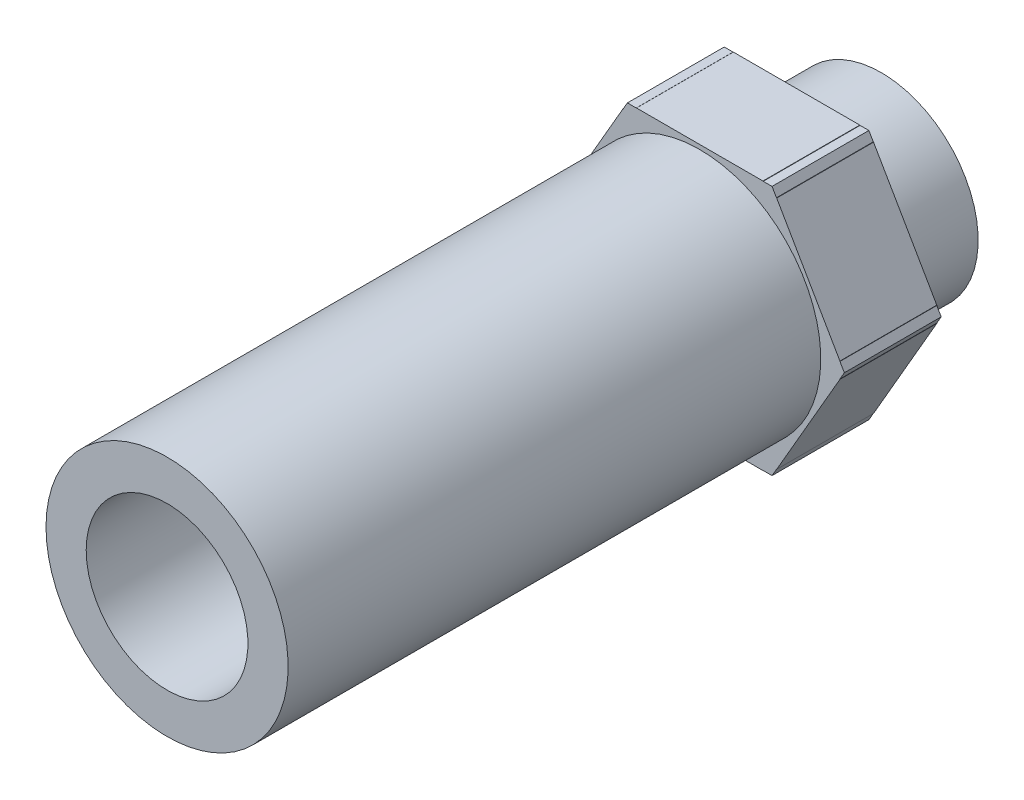
ISO-10303-21;
HEADER;
FILE_DESCRIPTION(('STEP AP214'),'2;1');
FILE_NAME('part.step','',(''),(''),'','','');
FILE_SCHEMA(('AUTOMOTIVE_DESIGN { 1 0 10303 214 1 1 1 1 }'));
ENDSEC;
DATA;
#1=APPLICATION_CONTEXT('core data for automotive mechanical design processes');
#2=APPLICATION_PROTOCOL_DEFINITION('international standard','automotive_design',2000,#1);
#3=PRODUCT_CONTEXT('',#1,'mechanical');
#4=PRODUCT('Part','Part','',(#3));
#5=PRODUCT_RELATED_PRODUCT_CATEGORY('part','',(#4));
#6=PRODUCT_DEFINITION_FORMATION('','',#4);
#7=PRODUCT_DEFINITION_CONTEXT('part definition',#1,'design');
#8=PRODUCT_DEFINITION('design','',#6,#7);
#9=PRODUCT_DEFINITION_SHAPE('','',#8);
#10=(LENGTH_UNIT() NAMED_UNIT(*) SI_UNIT(.MILLI.,.METRE.));
#11=(NAMED_UNIT(*) PLANE_ANGLE_UNIT() SI_UNIT($,.RADIAN.));
#12=(NAMED_UNIT(*) SI_UNIT($,.STERADIAN.) SOLID_ANGLE_UNIT());
#13=UNCERTAINTY_MEASURE_WITH_UNIT(LENGTH_MEASURE(1.E-05),#10,'distance_accuracy_value','');
#14=(GEOMETRIC_REPRESENTATION_CONTEXT(3) GLOBAL_UNCERTAINTY_ASSIGNED_CONTEXT((#13)) GLOBAL_UNIT_ASSIGNED_CONTEXT((#10,
#11,#12)) REPRESENTATION_CONTEXT('',''));
#15=CARTESIAN_POINT('',(0.,0.,0.));
#16=DIRECTION('',(0.,0.,1.));
#17=DIRECTION('',(1.,0.,0.));
#18=AXIS2_PLACEMENT_3D('',#15,#16,#17);
#19=CARTESIAN_POINT('',(0.,0.,-40.16));
#20=DIRECTION('',(0.,0.,-1.));
#21=DIRECTION('',(-1.,0.,0.));
#22=AXIS2_PLACEMENT_3D('',#19,#20,#21);
#23=CYLINDRICAL_SURFACE('',#22,29.);
#24=CARTESIAN_POINT('',(0.,0.,20.));
#25=DIRECTION('',(0.,0.,-1.));
#26=DIRECTION('',(-1.,0.,0.));
#27=AXIS2_PLACEMENT_3D('',#24,#25,#26);
#28=CIRCLE('',#27,29.);
#29=CARTESIAN_POINT('',(28.957156675231,-1.57577831122393,20.));
#30=VERTEX_POINT('',#29);
#31=CARTESIAN_POINT('',(28.9536877795527,-1.63828079528002,20.));
#32=VERTEX_POINT('',#31);
#33=EDGE_CURVE('E308',#30,#32,#28,.T.);
#34=ORIENTED_EDGE('',*,*,#33,.T.);
#35=DIRECTION('',(0.,0.,-1.));
#36=VECTOR('',#35,1.);
#37=CARTESIAN_POINT('',(28.9536877795527,-1.63828079528003,-40.16));
#38=LINE('',#37,#36);
#39=CARTESIAN_POINT('',(28.9536877795527,-1.63828079528003,0.));
#40=VERTEX_POINT('',#39);
#41=EDGE_CURVE('E307',#32,#40,#38,.T.);
#42=ORIENTED_EDGE('',*,*,#41,.T.);
#43=CARTESIAN_POINT('',(0.,0.,0.));
#44=DIRECTION('',(0.,0.,-1.));
#45=DIRECTION('',(-1.,0.,0.));
#46=AXIS2_PLACEMENT_3D('',#43,#44,#45);
#47=CIRCLE('',#46,29.);
#48=CARTESIAN_POINT('',(28.957156675231,-1.57577831122393,0.));
#49=VERTEX_POINT('',#48);
#50=EDGE_CURVE('E261',#49,#40,#47,.T.);
#51=ORIENTED_EDGE('',*,*,#50,.F.);
#52=DIRECTION('',(0.,0.,-1.));
#53=VECTOR('',#52,1.);
#54=CARTESIAN_POINT('',(28.957156675231,-1.57577831122395,-40.16));
#55=LINE('',#54,#53);
#56=EDGE_CURVE('E305',#30,#49,#55,.T.);
#57=ORIENTED_EDGE('',*,*,#56,.F.);
#58=EDGE_LOOP('',(#34,#42,#51,#57));
#59=FACE_BOUND('',#58,.T.);
#60=ADVANCED_FACE('F34',(#59),#23,.T.);
#61=CARTESIAN_POINT('',(15.8432423858679,24.2897441465043,20.));
#62=VERTEX_POINT('',#61);
#63=CARTESIAN_POINT('',(15.8956366770209,24.2554887526957,20.));
#64=VERTEX_POINT('',#63);
#65=EDGE_CURVE('E441',#62,#64,#28,.T.);
#66=ORIENTED_EDGE('',*,*,#65,.T.);
#67=DIRECTION('',(0.,0.,-1.));
#68=VECTOR('',#67,1.);
#69=CARTESIAN_POINT('',(15.8956366770209,24.2554887526957,-40.16));
#70=LINE('',#69,#68);
#71=CARTESIAN_POINT('',(15.8956366770209,24.2554887526957,0.));
#72=VERTEX_POINT('',#71);
#73=EDGE_CURVE('E315',#64,#72,#70,.T.);
#74=ORIENTED_EDGE('',*,*,#73,.T.);
#75=CARTESIAN_POINT('',(15.8432423858679,24.2897441465043,0.));
#76=VERTEX_POINT('',#75);
#77=EDGE_CURVE('E286',#76,#72,#47,.T.);
#78=ORIENTED_EDGE('',*,*,#77,.F.);
#79=DIRECTION('',(0.,0.,-1.));
#80=VECTOR('',#79,1.);
#81=CARTESIAN_POINT('',(15.8432423858679,24.2897441465043,-40.16));
#82=LINE('',#81,#80);
#83=EDGE_CURVE('E406',#62,#76,#82,.T.);
#84=ORIENTED_EDGE('',*,*,#83,.F.);
#85=EDGE_LOOP('',(#66,#74,#78,#84));
#86=FACE_BOUND('',#85,.T.);
#87=ADVANCED_FACE('F486',(#86),#23,.T.);
#88=CARTESIAN_POINT('',(-13.1139142893632,25.8655224577281,20.));
#89=VERTEX_POINT('',#88);
#90=CARTESIAN_POINT('',(-13.0580511025318,25.8937695479756,20.));
#91=VERTEX_POINT('',#90);
#92=EDGE_CURVE('E276',#89,#91,#28,.T.);
#93=ORIENTED_EDGE('',*,*,#92,.T.);
#94=DIRECTION('',(0.,0.,-1.));
#95=VECTOR('',#94,1.);
#96=CARTESIAN_POINT('',(-13.0580511025318,25.8937695479756,-40.16));
#97=LINE('',#96,#95);
#98=CARTESIAN_POINT('',(-13.0580511025318,25.8937695479756,0.));
#99=VERTEX_POINT('',#98);
#100=EDGE_CURVE('E480',#91,#99,#97,.T.);
#101=ORIENTED_EDGE('',*,*,#100,.T.);
#102=CARTESIAN_POINT('',(-13.1139142893632,25.8655224577281,0.));
#103=VERTEX_POINT('',#102);
#104=EDGE_CURVE('E277',#103,#99,#47,.T.);
#105=ORIENTED_EDGE('',*,*,#104,.F.);
#106=DIRECTION('',(0.,0.,-1.));
#107=VECTOR('',#106,1.);
#108=CARTESIAN_POINT('',(-13.1139142893632,25.8655224577281,-40.16));
#109=LINE('',#108,#107);
#110=EDGE_CURVE('E400',#89,#103,#109,.T.);
#111=ORIENTED_EDGE('',*,*,#110,.F.);
#112=EDGE_LOOP('',(#93,#101,#105,#111));
#113=FACE_BOUND('',#112,.T.);
#114=ADVANCED_FACE('F528',(#113),#23,.T.);
#115=CARTESIAN_POINT('',(-28.957156675231,1.57577831122371,20.));
#116=VERTEX_POINT('',#115);
#117=CARTESIAN_POINT('',(-28.9536877795527,1.63828079527978,20.));
#118=VERTEX_POINT('',#117);
#119=EDGE_CURVE('E267',#116,#118,#28,.T.);
#120=ORIENTED_EDGE('',*,*,#119,.T.);
#121=DIRECTION('',(0.,0.,-1.));
#122=VECTOR('',#121,1.);
#123=CARTESIAN_POINT('',(-28.9536877795527,1.63828079527978,-40.16));
#124=LINE('',#123,#122);
#125=CARTESIAN_POINT('',(-28.9536877795527,1.63828079527979,0.));
#126=VERTEX_POINT('',#125);
#127=EDGE_CURVE('E57',#118,#126,#124,.T.);
#128=ORIENTED_EDGE('',*,*,#127,.T.);
#129=CARTESIAN_POINT('',(-28.957156675231,1.57577831122372,0.));
#130=VERTEX_POINT('',#129);
#131=EDGE_CURVE('E264',#130,#126,#47,.T.);
#132=ORIENTED_EDGE('',*,*,#131,.F.);
#133=DIRECTION('',(0.,0.,-1.));
#134=VECTOR('',#133,1.);
#135=CARTESIAN_POINT('',(-28.957156675231,1.57577831122371,-40.16));
#136=LINE('',#135,#134);
#137=EDGE_CURVE('E394',#116,#130,#136,.T.);
#138=ORIENTED_EDGE('',*,*,#137,.F.);
#139=EDGE_LOOP('',(#120,#128,#132,#138));
#140=FACE_BOUND('',#139,.T.);
#141=ADVANCED_FACE('F560',(#140),#23,.T.);
#142=CARTESIAN_POINT('',(-15.8432423858677,-24.2897441465044,20.));
#143=VERTEX_POINT('',#142);
#144=CARTESIAN_POINT('',(-15.8956366770207,-24.2554887526958,20.));
#145=VERTEX_POINT('',#144);
#146=EDGE_CURVE('E427',#143,#145,#28,.T.);
#147=ORIENTED_EDGE('',*,*,#146,.T.);
#148=DIRECTION('',(0.,0.,-1.));
#149=VECTOR('',#148,1.);
#150=CARTESIAN_POINT('',(-15.8956366770207,-24.2554887526958,-40.16));
#151=LINE('',#150,#149);
#152=CARTESIAN_POINT('',(-15.8956366770207,-24.2554887526958,0.));
#153=VERTEX_POINT('',#152);
#154=EDGE_CURVE('E49',#145,#153,#151,.T.);
#155=ORIENTED_EDGE('',*,*,#154,.T.);
#156=CARTESIAN_POINT('',(-15.8432423858677,-24.2897441465044,0.));
#157=VERTEX_POINT('',#156);
#158=EDGE_CURVE('E257',#157,#153,#47,.T.);
#159=ORIENTED_EDGE('',*,*,#158,.F.);
#160=DIRECTION('',(0.,0.,-1.));
#161=VECTOR('',#160,1.);
#162=CARTESIAN_POINT('',(-15.8432423858677,-24.2897441465044,-40.16));
#163=LINE('',#162,#161);
#164=EDGE_CURVE('E388',#143,#157,#163,.T.);
#165=ORIENTED_EDGE('',*,*,#164,.F.);
#166=EDGE_LOOP('',(#147,#155,#159,#165));
#167=FACE_BOUND('',#166,.T.);
#168=ADVANCED_FACE('F469',(#167),#23,.T.);
#169=CARTESIAN_POINT('',(13.1139142893634,-25.865522457728,20.));
#170=VERTEX_POINT('',#169);
#171=CARTESIAN_POINT('',(13.058051102532,-25.8937695479755,20.));
#172=VERTEX_POINT('',#171);
#173=EDGE_CURVE('E434',#170,#172,#28,.T.);
#174=ORIENTED_EDGE('',*,*,#173,.T.);
#175=DIRECTION('',(0.,0.,-1.));
#176=VECTOR('',#175,1.);
#177=CARTESIAN_POINT('',(13.058051102532,-25.8937695479755,-40.16));
#178=LINE('',#177,#176);
#179=CARTESIAN_POINT('',(13.058051102532,-25.8937695479755,0.));
#180=VERTEX_POINT('',#179);
#181=EDGE_CURVE('E240',#172,#180,#178,.T.);
#182=ORIENTED_EDGE('',*,*,#181,.T.);
#183=CARTESIAN_POINT('',(13.1139142893634,-25.865522457728,0.));
#184=VERTEX_POINT('',#183);
#185=EDGE_CURVE('E250',#184,#180,#47,.T.);
#186=ORIENTED_EDGE('',*,*,#185,.F.);
#187=DIRECTION('',(0.,0.,-1.));
#188=VECTOR('',#187,1.);
#189=CARTESIAN_POINT('',(13.1139142893634,-25.865522457728,-40.16));
#190=LINE('',#189,#188);
#191=EDGE_CURVE('E382',#170,#184,#190,.T.);
#192=ORIENTED_EDGE('',*,*,#191,.F.);
#193=EDGE_LOOP('',(#174,#182,#186,#192));
#194=FACE_BOUND('',#193,.T.);
#195=ADVANCED_FACE('F537',(#194),#23,.T.);
#196=CARTESIAN_POINT('',(0.,0.,-40.16));
#197=DIRECTION('',(0.,0.,-1.));
#198=DIRECTION('',(-1.,0.,0.));
#199=AXIS2_PLACEMENT_3D('',#196,#197,#198);
#200=CYLINDRICAL_SURFACE('',#199,16.7);
#201=CARTESIAN_POINT('',(0.,0.,-17.5));
#202=DIRECTION('',(0.,0.,-1.));
#203=DIRECTION('',(-1.,0.,0.));
#204=AXIS2_PLACEMENT_3D('',#201,#202,#203);
#205=CIRCLE('',#204,16.7);
#206=CARTESIAN_POINT('',(-16.7,0.,-17.5));
#207=VERTEX_POINT('',#206);
#208=EDGE_CURVE('E417',#207,#207,#205,.T.);
#209=ORIENTED_EDGE('',*,*,#208,.T.);
#210=EDGE_LOOP('',(#209));
#211=FACE_BOUND('',#210,.T.);
#212=CARTESIAN_POINT('',(0.,0.,0.));
#213=DIRECTION('',(0.,0.,1.));
#214=DIRECTION('',(1.,0.,0.));
#215=AXIS2_PLACEMENT_3D('',#212,#213,#214);
#216=CIRCLE('',#215,16.7);
#217=CARTESIAN_POINT('',(16.7,0.,0.));
#218=VERTEX_POINT('',#217);
#219=EDGE_CURVE('E414',#218,#218,#216,.F.);
#220=ORIENTED_EDGE('',*,*,#219,.F.);
#221=EDGE_LOOP('',(#220));
#222=FACE_BOUND('',#221,.T.);
#223=ADVANCED_FACE('F531',(#211,#222),#200,.F.);
#224=CARTESIAN_POINT('',(15.8956366770213,-24.2554887526955,0.));
#225=VERTEX_POINT('',#224);
#226=CARTESIAN_POINT('',(15.8432423858683,-24.289744146504,0.));
#227=VERTEX_POINT('',#226);
#228=EDGE_CURVE('E259',#225,#227,#47,.T.);
#229=ORIENTED_EDGE('',*,*,#228,.F.);
#230=DIRECTION('',(0.,0.,-1.));
#231=VECTOR('',#230,1.);
#232=CARTESIAN_POINT('',(15.8956366770213,-24.2554887526955,-40.16));
#233=LINE('',#232,#231);
#234=CARTESIAN_POINT('',(15.8956366770213,-24.2554887526955,20.));
#235=VERTEX_POINT('',#234);
#236=EDGE_CURVE('E310',#225,#235,#233,.F.);
#237=ORIENTED_EDGE('',*,*,#236,.T.);
#238=CARTESIAN_POINT('',(15.8432423858683,-24.289744146504,20.));
#239=VERTEX_POINT('',#238);
#240=EDGE_CURVE('E448',#235,#239,#28,.T.);
#241=ORIENTED_EDGE('',*,*,#240,.T.);
#242=DIRECTION('',(0.,0.,-1.));
#243=VECTOR('',#242,1.);
#244=CARTESIAN_POINT('',(15.8432423858683,-24.289744146504,-40.16));
#245=LINE('',#244,#243);
#246=EDGE_CURVE('E409',#227,#239,#245,.F.);
#247=ORIENTED_EDGE('',*,*,#246,.F.);
#248=EDGE_LOOP('',(#229,#237,#241,#247));
#249=FACE_BOUND('',#248,.T.);
#250=ADVANCED_FACE('F524',(#249),#23,.T.);
#251=CARTESIAN_POINT('',(28.9536877795527,1.63828079527999,0.));
#252=VERTEX_POINT('',#251);
#253=CARTESIAN_POINT('',(28.957156675231,1.57577831122391,0.));
#254=VERTEX_POINT('',#253);
#255=EDGE_CURVE('E263',#252,#254,#47,.T.);
#256=ORIENTED_EDGE('',*,*,#255,.F.);
#257=DIRECTION('',(0.,0.,-1.));
#258=VECTOR('',#257,1.);
#259=CARTESIAN_POINT('',(28.9536877795527,1.63828079527999,-40.16));
#260=LINE('',#259,#258);
#261=CARTESIAN_POINT('',(28.9536877795527,1.63828079527998,20.));
#262=VERTEX_POINT('',#261);
#263=EDGE_CURVE('E483',#252,#262,#260,.F.);
#264=ORIENTED_EDGE('',*,*,#263,.T.);
#265=CARTESIAN_POINT('',(28.957156675231,1.5757783112239,20.));
#266=VERTEX_POINT('',#265);
#267=EDGE_CURVE('E442',#262,#266,#28,.T.);
#268=ORIENTED_EDGE('',*,*,#267,.T.);
#269=DIRECTION('',(0.,0.,-1.));
#270=VECTOR('',#269,1.);
#271=CARTESIAN_POINT('',(28.957156675231,1.57577831122392,-40.16));
#272=LINE('',#271,#270);
#273=EDGE_CURVE('E403',#254,#266,#272,.F.);
#274=ORIENTED_EDGE('',*,*,#273,.F.);
#275=EDGE_LOOP('',(#256,#264,#268,#274));
#276=FACE_BOUND('',#275,.T.);
#277=ADVANCED_FACE('F530',(#276),#23,.T.);
#278=CARTESIAN_POINT('',(13.0580511025316,25.8937695479757,0.));
#279=VERTEX_POINT('',#278);
#280=CARTESIAN_POINT('',(13.113914289363,25.8655224577282,0.));
#281=VERTEX_POINT('',#280);
#282=EDGE_CURVE('E278',#279,#281,#47,.T.);
#283=ORIENTED_EDGE('',*,*,#282,.F.);
#284=DIRECTION('',(0.,0.,-1.));
#285=VECTOR('',#284,1.);
#286=CARTESIAN_POINT('',(13.0580511025316,25.8937695479757,-40.16));
#287=LINE('',#286,#285);
#288=CARTESIAN_POINT('',(13.0580511025316,25.8937695479757,20.));
#289=VERTEX_POINT('',#288);
#290=EDGE_CURVE('E478',#279,#289,#287,.F.);
#291=ORIENTED_EDGE('',*,*,#290,.T.);
#292=CARTESIAN_POINT('',(13.113914289363,25.8655224577282,20.));
#293=VERTEX_POINT('',#292);
#294=EDGE_CURVE('E435',#289,#293,#28,.T.);
#295=ORIENTED_EDGE('',*,*,#294,.T.);
#296=DIRECTION('',(0.,0.,-1.));
#297=VECTOR('',#296,1.);
#298=CARTESIAN_POINT('',(13.113914289363,25.8655224577282,-40.16));
#299=LINE('',#298,#297);
#300=EDGE_CURVE('E397',#281,#293,#299,.F.);
#301=ORIENTED_EDGE('',*,*,#300,.F.);
#302=EDGE_LOOP('',(#283,#291,#295,#301));
#303=FACE_BOUND('',#302,.T.);
#304=ADVANCED_FACE('F536',(#303),#23,.T.);
#305=CARTESIAN_POINT('',(-15.8956366770211,24.2554887526956,0.));
#306=VERTEX_POINT('',#305);
#307=CARTESIAN_POINT('',(-15.8432423858681,24.2897441465042,0.));
#308=VERTEX_POINT('',#307);
#309=EDGE_CURVE('E268',#306,#308,#47,.T.);
#310=ORIENTED_EDGE('',*,*,#309,.F.);
#311=DIRECTION('',(0.,0.,-1.));
#312=VECTOR('',#311,1.);
#313=CARTESIAN_POINT('',(-15.8956366770211,24.2554887526956,-40.16));
#314=LINE('',#313,#312);
#315=CARTESIAN_POINT('',(-15.8956366770211,24.2554887526956,20.));
#316=VERTEX_POINT('',#315);
#317=EDGE_CURVE('E470',#306,#316,#314,.F.);
#318=ORIENTED_EDGE('',*,*,#317,.T.);
#319=CARTESIAN_POINT('',(-15.8432423858681,24.2897441465042,20.));
#320=VERTEX_POINT('',#319);
#321=EDGE_CURVE('E274',#316,#320,#28,.T.);
#322=ORIENTED_EDGE('',*,*,#321,.T.);
#323=DIRECTION('',(0.,0.,-1.));
#324=VECTOR('',#323,1.);
#325=CARTESIAN_POINT('',(-15.8432423858681,24.2897441465042,-40.16));
#326=LINE('',#325,#324);
#327=EDGE_CURVE('E391',#308,#320,#326,.F.);
#328=ORIENTED_EDGE('',*,*,#327,.F.);
#329=EDGE_LOOP('',(#310,#318,#322,#328));
#330=FACE_BOUND('',#329,.T.);
#331=ADVANCED_FACE('F546',(#330),#23,.T.);
#332=CARTESIAN_POINT('',(-28.9536877795526,-1.63828079528018,0.));
#333=VERTEX_POINT('',#332);
#334=CARTESIAN_POINT('',(-28.957156675231,-1.57577831122411,0.));
#335=VERTEX_POINT('',#334);
#336=EDGE_CURVE('E260',#333,#335,#47,.T.);
#337=ORIENTED_EDGE('',*,*,#336,.F.);
#338=DIRECTION('',(0.,0.,-1.));
#339=VECTOR('',#338,1.);
#340=CARTESIAN_POINT('',(-28.9536877795526,-1.63828079528018,-40.16));
#341=LINE('',#340,#339);
#342=CARTESIAN_POINT('',(-28.9536877795526,-1.63828079528018,20.));
#343=VERTEX_POINT('',#342);
#344=EDGE_CURVE('E471',#333,#343,#341,.F.);
#345=ORIENTED_EDGE('',*,*,#344,.T.);
#346=CARTESIAN_POINT('',(-28.957156675231,-1.57577831122414,20.));
#347=VERTEX_POINT('',#346);
#348=EDGE_CURVE('E275',#343,#347,#28,.T.);
#349=ORIENTED_EDGE('',*,*,#348,.T.);
#350=DIRECTION('',(0.,0.,-1.));
#351=VECTOR('',#350,1.);
#352=CARTESIAN_POINT('',(-28.957156675231,-1.57577831122412,-40.16));
#353=LINE('',#352,#351);
#354=EDGE_CURVE('E385',#335,#347,#353,.F.);
#355=ORIENTED_EDGE('',*,*,#354,.F.);
#356=EDGE_LOOP('',(#337,#345,#349,#355));
#357=FACE_BOUND('',#356,.T.);
#358=ADVANCED_FACE('F540',(#357),#23,.T.);
#359=CARTESIAN_POINT('',(-13.0580511025314,-25.8937695479758,0.));
#360=VERTEX_POINT('',#359);
#361=CARTESIAN_POINT('',(-13.1139142893628,-25.8655224577283,0.));
#362=VERTEX_POINT('',#361);
#363=EDGE_CURVE('E247',#360,#362,#47,.T.);
#364=ORIENTED_EDGE('',*,*,#363,.F.);
#365=DIRECTION('',(0.,0.,-1.));
#366=VECTOR('',#365,1.);
#367=CARTESIAN_POINT('',(-13.0580511025314,-25.8937695479758,-40.16));
#368=LINE('',#367,#366);
#369=CARTESIAN_POINT('',(-13.0580511025314,-25.8937695479758,20.));
#370=VERTEX_POINT('',#369);
#371=EDGE_CURVE('E230',#360,#370,#368,.F.);
#372=ORIENTED_EDGE('',*,*,#371,.T.);
#373=CARTESIAN_POINT('',(-13.1139142893628,-25.8655224577283,20.));
#374=VERTEX_POINT('',#373);
#375=EDGE_CURVE('E433',#370,#374,#28,.T.);
#376=ORIENTED_EDGE('',*,*,#375,.T.);
#377=DIRECTION('',(0.,0.,-1.));
#378=VECTOR('',#377,1.);
#379=CARTESIAN_POINT('',(-13.1139142893628,-25.8655224577283,-40.16));
#380=LINE('',#379,#378);
#381=EDGE_CURVE('E256',#362,#374,#380,.F.);
#382=ORIENTED_EDGE('',*,*,#381,.F.);
#383=EDGE_LOOP('',(#364,#372,#376,#382));
#384=FACE_BOUND('',#383,.T.);
#385=ADVANCED_FACE('F254',(#384),#23,.T.);
#386=CARTESIAN_POINT('',(0.,0.,20.));
#387=DIRECTION('',(0.,0.,1.));
#388=DIRECTION('',(1.,0.,0.));
#389=AXIS2_PLACEMENT_3D('',#386,#387,#388);
#390=CIRCLE('',#389,16.7);
#391=CARTESIAN_POINT('',(16.7,0.,20.));
#392=VERTEX_POINT('',#391);
#393=EDGE_CURVE('E378',#392,#392,#390,.F.);
#394=ORIENTED_EDGE('',*,*,#393,.T.);
#395=EDGE_LOOP('',(#394));
#396=FACE_BOUND('',#395,.T.);
#397=CARTESIAN_POINT('',(0.,0.,130.));
#398=DIRECTION('',(0.,0.,-1.));
#399=DIRECTION('',(-1.,0.,0.));
#400=AXIS2_PLACEMENT_3D('',#397,#398,#399);
#401=CIRCLE('',#400,16.7);
#402=CARTESIAN_POINT('',(-16.7,0.,130.));
#403=VERTEX_POINT('',#402);
#404=EDGE_CURVE('E413',#403,#403,#401,.T.);
#405=ORIENTED_EDGE('',*,*,#404,.F.);
#406=EDGE_LOOP('',(#405));
#407=FACE_BOUND('',#406,.T.);
#408=ADVANCED_FACE('F36',(#396,#407),#200,.F.);
#409=CARTESIAN_POINT('',(16.7,0.,-17.5));
#410=DIRECTION('',(0.,0.,1.));
#411=DIRECTION('',(1.,0.,0.));
#412=AXIS2_PLACEMENT_3D('',#409,#410,#411);
#413=PLANE('',#412);
#414=ORIENTED_EDGE('',*,*,#208,.F.);
#415=EDGE_LOOP('',(#414));
#416=FACE_BOUND('',#415,.T.);
#417=CARTESIAN_POINT('',(0.,0.,-17.5));
#418=DIRECTION('',(0.,0.,-1.));
#419=DIRECTION('',(-1.,0.,0.));
#420=AXIS2_PLACEMENT_3D('',#417,#418,#419);
#421=CIRCLE('',#420,20.);
#422=CARTESIAN_POINT('',(-20.,0.,-17.5));
#423=VERTEX_POINT('',#422);
#424=EDGE_CURVE('E504',#423,#423,#421,.T.);
#425=ORIENTED_EDGE('',*,*,#424,.T.);
#426=EDGE_LOOP('',(#425));
#427=FACE_BOUND('',#426,.T.);
#428=ADVANCED_FACE('F519',(#416,#427),#413,.F.);
#429=CARTESIAN_POINT('',(0.,0.,-40.16));
#430=DIRECTION('',(0.,0.,-1.));
#431=DIRECTION('',(-1.,0.,0.));
#432=AXIS2_PLACEMENT_3D('',#429,#430,#431);
#433=CYLINDRICAL_SURFACE('',#432,20.);
#434=ORIENTED_EDGE('',*,*,#424,.F.);
#435=EDGE_LOOP('',(#434));
#436=FACE_BOUND('',#435,.T.);
#437=CARTESIAN_POINT('',(0.,0.,0.));
#438=DIRECTION('',(0.,0.,-1.));
#439=DIRECTION('',(-1.,0.,0.));
#440=AXIS2_PLACEMENT_3D('',#437,#438,#439);
#441=CIRCLE('',#440,20.);
#442=CARTESIAN_POINT('',(-20.,0.,0.));
#443=VERTEX_POINT('',#442);
#444=EDGE_CURVE('E284',#443,#443,#441,.T.);
#445=ORIENTED_EDGE('',*,*,#444,.T.);
#446=EDGE_LOOP('',(#445));
#447=FACE_BOUND('',#446,.T.);
#448=ADVANCED_FACE('F509',(#436,#447),#433,.T.);
#449=CARTESIAN_POINT('',(20.,0.,0.));
#450=DIRECTION('',(0.,0.,1.));
#451=DIRECTION('',(1.,0.,0.));
#452=AXIS2_PLACEMENT_3D('',#449,#450,#451);
#453=PLANE('',#452);
#454=ORIENTED_EDGE('',*,*,#444,.F.);
#455=EDGE_LOOP('',(#454));
#456=FACE_BOUND('',#455,.T.);
#457=ORIENTED_EDGE('',*,*,#50,.T.);
#458=DIRECTION('',(0.499999999999995,0.866025403784441,0.));
#459=VECTOR('',#458,1.);
#460=CARTESIAN_POINT('',(14.9497748188582,-25.8937695479755,0.));
#461=LINE('',#460,#459);
#462=EDGE_CURVE('E296',#225,#40,#461,.T.);
#463=ORIENTED_EDGE('',*,*,#462,.F.);
#464=ORIENTED_EDGE('',*,*,#228,.T.);
#465=DIRECTION('',(0.499999999999995,0.866025403784442,0.));
#466=VECTOR('',#465,1.);
#467=CARTESIAN_POINT('',(14.9334663537,-25.865522457728,0.));
#468=LINE('',#467,#466);
#469=CARTESIAN_POINT('',(14.9334663537,-25.865522457728,0.));
#470=VERTEX_POINT('',#469);
#471=EDGE_CURVE('E312',#470,#227,#468,.T.);
#472=ORIENTED_EDGE('',*,*,#471,.F.);
#473=DIRECTION('',(1.,0.,0.));
#474=VECTOR('',#473,1.);
#475=CARTESIAN_POINT('',(-14.9334663536994,-25.8655224577283,0.));
#476=LINE('',#475,#474);
#477=EDGE_CURVE('E358',#184,#470,#476,.T.);
#478=ORIENTED_EDGE('',*,*,#477,.F.);
#479=ORIENTED_EDGE('',*,*,#185,.T.);
#480=DIRECTION('',(1.,0.,0.));
#481=VECTOR('',#480,1.);
#482=CARTESIAN_POINT('',(-14.9497748188576,-25.8937695479758,0.));
#483=LINE('',#482,#481);
#484=EDGE_CURVE('E233',#360,#180,#483,.T.);
#485=ORIENTED_EDGE('',*,*,#484,.F.);
#486=ORIENTED_EDGE('',*,*,#363,.T.);
#487=CARTESIAN_POINT('',(-14.9334663536994,-25.8655224577283,0.));
#488=VERTEX_POINT('',#487);
#489=EDGE_CURVE('E359',#488,#362,#476,.T.);
#490=ORIENTED_EDGE('',*,*,#489,.F.);
#491=DIRECTION('',(0.500000000000007,-0.866025403784434,0.));
#492=VECTOR('',#491,1.);
#493=CARTESIAN_POINT('',(-29.8669327073993,-2.08559676392737E-13,0.));
#494=LINE('',#493,#492);
#495=EDGE_CURVE('E355',#157,#488,#494,.T.);
#496=ORIENTED_EDGE('',*,*,#495,.F.);
#497=ORIENTED_EDGE('',*,*,#158,.T.);
#498=DIRECTION('',(0.500000000000007,-0.866025403784434,0.));
#499=VECTOR('',#498,1.);
#500=CARTESIAN_POINT('',(-29.8995496377157,-2.08787439199797E-13,0.));
#501=LINE('',#500,#499);
#502=EDGE_CURVE('E251',#333,#153,#501,.T.);
#503=ORIENTED_EDGE('',*,*,#502,.F.);
#504=ORIENTED_EDGE('',*,*,#336,.T.);
#505=CARTESIAN_POINT('',(-29.8669327073993,-2.08559676392737E-13,0.));
#506=VERTEX_POINT('',#505);
#507=EDGE_CURVE('E356',#506,#335,#494,.T.);
#508=ORIENTED_EDGE('',*,*,#507,.F.);
#509=DIRECTION('',(-0.499999999999995,-0.866025403784441,0.));
#510=VECTOR('',#509,1.);
#511=CARTESIAN_POINT('',(-14.9334663536998,25.8655224577281,0.));
#512=LINE('',#511,#510);
#513=EDGE_CURVE('E352',#130,#506,#512,.T.);
#514=ORIENTED_EDGE('',*,*,#513,.F.);
#515=ORIENTED_EDGE('',*,*,#131,.T.);
#516=DIRECTION('',(-0.499999999999995,-0.866025403784441,0.));
#517=VECTOR('',#516,1.);
#518=CARTESIAN_POINT('',(-14.949774818858,25.8937695479756,0.));
#519=LINE('',#518,#517);
#520=EDGE_CURVE('E613',#306,#126,#519,.T.);
#521=ORIENTED_EDGE('',*,*,#520,.F.);
#522=ORIENTED_EDGE('',*,*,#309,.T.);
#523=CARTESIAN_POINT('',(-14.9334663536998,25.8655224577281,0.));
#524=VERTEX_POINT('',#523);
#525=EDGE_CURVE('E353',#524,#308,#512,.T.);
#526=ORIENTED_EDGE('',*,*,#525,.F.);
#527=DIRECTION('',(-1.,0.,0.));
#528=VECTOR('',#527,1.);
#529=CARTESIAN_POINT('',(14.9334663536996,25.8655224577282,0.));
#530=LINE('',#529,#528);
#531=EDGE_CURVE('E349',#103,#524,#530,.T.);
#532=ORIENTED_EDGE('',*,*,#531,.F.);
#533=ORIENTED_EDGE('',*,*,#104,.T.);
#534=DIRECTION('',(-1.,0.,0.));
#535=VECTOR('',#534,1.);
#536=CARTESIAN_POINT('',(14.9497748188578,25.8937695479757,0.));
#537=LINE('',#536,#535);
#538=EDGE_CURVE('E611',#279,#99,#537,.T.);
#539=ORIENTED_EDGE('',*,*,#538,.F.);
#540=ORIENTED_EDGE('',*,*,#282,.T.);
#541=CARTESIAN_POINT('',(14.9334663536996,25.8655224577282,0.));
#542=VERTEX_POINT('',#541);
#543=EDGE_CURVE('E350',#542,#281,#530,.T.);
#544=ORIENTED_EDGE('',*,*,#543,.F.);
#545=DIRECTION('',(-0.500000000000001,0.866025403784438,0.));
#546=VECTOR('',#545,1.);
#547=CARTESIAN_POINT('',(29.8669327073993,0.,0.));
#548=LINE('',#547,#546);
#549=EDGE_CURVE('E345',#76,#542,#548,.T.);
#550=ORIENTED_EDGE('',*,*,#549,.F.);
#551=ORIENTED_EDGE('',*,*,#77,.T.);
#552=DIRECTION('',(-0.500000000000001,0.866025403784438,0.));
#553=VECTOR('',#552,1.);
#554=CARTESIAN_POINT('',(29.8995496377158,0.,0.));
#555=LINE('',#554,#553);
#556=EDGE_CURVE('E492',#252,#72,#555,.T.);
#557=ORIENTED_EDGE('',*,*,#556,.F.);
#558=ORIENTED_EDGE('',*,*,#255,.T.);
#559=CARTESIAN_POINT('',(29.8669327073993,0.,0.));
#560=VERTEX_POINT('',#559);
#561=EDGE_CURVE('E346',#560,#254,#548,.T.);
#562=ORIENTED_EDGE('',*,*,#561,.F.);
#563=EDGE_CURVE('E299',#49,#560,#468,.T.);
#564=ORIENTED_EDGE('',*,*,#563,.F.);
#565=EDGE_LOOP('',(#457,#463,#464,#472,#478,#479,#485,#486,#490,#496,#497,#503,#504,#508,#514,
#515,#521,#522,#526,#532,#533,#539,#540,#544,#550,#551,#557,#558,#562,#564));
#566=FACE_BOUND('',#565,.T.);
#567=ADVANCED_FACE('F245',(#456,#566),#453,.F.);
#568=CARTESIAN_POINT('',(29.,0.,20.));
#569=DIRECTION('',(0.,0.,-1.));
#570=DIRECTION('',(-1.,0.,0.));
#571=AXIS2_PLACEMENT_3D('',#568,#569,#570);
#572=PLANE('',#571);
#573=ORIENTED_EDGE('',*,*,#240,.F.);
#574=DIRECTION('',(0.499999999999995,0.866025403784442,0.));
#575=VECTOR('',#574,1.);
#576=CARTESIAN_POINT('',(29.6746622282868,-0.389516419113463,20.));
#577=LINE('',#576,#575);
#578=EDGE_CURVE('E12',#235,#32,#577,.T.);
#579=ORIENTED_EDGE('',*,*,#578,.T.);
#580=ORIENTED_EDGE('',*,*,#33,.F.);
#581=DIRECTION('',(0.499999999999995,0.866025403784442,0.));
#582=VECTOR('',#581,1.);
#583=CARTESIAN_POINT('',(14.9334663537,-25.865522457728,20.));
#584=LINE('',#583,#582);
#585=CARTESIAN_POINT('',(29.8669327073993,0.,20.));
#586=VERTEX_POINT('',#585);
#587=EDGE_CURVE('E323',#30,#586,#584,.T.);
#588=ORIENTED_EDGE('',*,*,#587,.T.);
#589=DIRECTION('',(-0.500000000000001,0.866025403784438,0.));
#590=VECTOR('',#589,1.);
#591=CARTESIAN_POINT('',(29.8669327073993,0.,20.));
#592=LINE('',#591,#590);
#593=EDGE_CURVE('E324',#586,#266,#592,.T.);
#594=ORIENTED_EDGE('',*,*,#593,.T.);
#595=ORIENTED_EDGE('',*,*,#267,.F.);
#596=DIRECTION('',(-0.500000000000001,0.866025403784438,0.));
#597=VECTOR('',#596,1.);
#598=CARTESIAN_POINT('',(29.6746622282868,0.389516419113465,20.));
#599=LINE('',#598,#597);
#600=EDGE_CURVE('E42',#262,#64,#599,.T.);
#601=ORIENTED_EDGE('',*,*,#600,.T.);
#602=ORIENTED_EDGE('',*,*,#65,.F.);
#603=CARTESIAN_POINT('',(14.9334663536996,25.8655224577282,20.));
#604=VERTEX_POINT('',#603);
#605=EDGE_CURVE('E322',#62,#604,#592,.T.);
#606=ORIENTED_EDGE('',*,*,#605,.T.);
#607=DIRECTION('',(-1.,0.,0.));
#608=VECTOR('',#607,1.);
#609=CARTESIAN_POINT('',(14.9334663536996,25.8655224577282,20.));
#610=LINE('',#609,#608);
#611=EDGE_CURVE('E328',#604,#293,#610,.T.);
#612=ORIENTED_EDGE('',*,*,#611,.T.);
#613=ORIENTED_EDGE('',*,*,#294,.F.);
#614=DIRECTION('',(-1.,0.,0.));
#615=VECTOR('',#614,1.);
#616=CARTESIAN_POINT('',(28.9999999999999,25.8937695479757,20.));
#617=LINE('',#616,#615);
#618=EDGE_CURVE('E493',#289,#91,#617,.T.);
#619=ORIENTED_EDGE('',*,*,#618,.T.);
#620=ORIENTED_EDGE('',*,*,#92,.F.);
#621=CARTESIAN_POINT('',(-14.9334663536998,25.8655224577281,20.));
#622=VERTEX_POINT('',#621);
#623=EDGE_CURVE('E327',#89,#622,#610,.T.);
#624=ORIENTED_EDGE('',*,*,#623,.T.);
#625=DIRECTION('',(-0.499999999999995,-0.866025403784441,0.));
#626=VECTOR('',#625,1.);
#627=CARTESIAN_POINT('',(-14.9334663536998,25.8655224577281,20.));
#628=LINE('',#627,#626);
#629=EDGE_CURVE('E332',#622,#320,#628,.T.);
#630=ORIENTED_EDGE('',*,*,#629,.T.);
#631=ORIENTED_EDGE('',*,*,#321,.F.);
#632=DIRECTION('',(-0.499999999999995,-0.866025403784442,0.));
#633=VECTOR('',#632,1.);
#634=CARTESIAN_POINT('',(-15.174662228287,25.504253128862,20.));
#635=LINE('',#634,#633);
#636=EDGE_CURVE('E495',#316,#118,#635,.T.);
#637=ORIENTED_EDGE('',*,*,#636,.T.);
#638=ORIENTED_EDGE('',*,*,#119,.F.);
#639=CARTESIAN_POINT('',(-29.8669327073993,-2.08559676392737E-13,20.));
#640=VERTEX_POINT('',#639);
#641=EDGE_CURVE('E331',#116,#640,#628,.T.);
#642=ORIENTED_EDGE('',*,*,#641,.T.);
#643=DIRECTION('',(0.500000000000007,-0.866025403784434,0.));
#644=VECTOR('',#643,1.);
#645=CARTESIAN_POINT('',(-29.8669327073993,-2.08559676392737E-13,20.));
#646=LINE('',#645,#644);
#647=EDGE_CURVE('E336',#640,#347,#646,.T.);
#648=ORIENTED_EDGE('',*,*,#647,.T.);
#649=ORIENTED_EDGE('',*,*,#348,.F.);
#650=DIRECTION('',(0.500000000000007,-0.866025403784435,0.));
#651=VECTOR('',#650,1.);
#652=CARTESIAN_POINT('',(-15.1746622282865,-25.5042531288625,20.));
#653=LINE('',#652,#651);
#654=EDGE_CURVE('E499',#343,#145,#653,.T.);
#655=ORIENTED_EDGE('',*,*,#654,.T.);
#656=ORIENTED_EDGE('',*,*,#146,.F.);
#657=CARTESIAN_POINT('',(-14.9334663536994,-25.8655224577283,20.));
#658=VERTEX_POINT('',#657);
#659=EDGE_CURVE('E335',#143,#658,#646,.T.);
#660=ORIENTED_EDGE('',*,*,#659,.T.);
#661=DIRECTION('',(1.,0.,0.));
#662=VECTOR('',#661,1.);
#663=CARTESIAN_POINT('',(-14.9334663536994,-25.8655224577283,20.));
#664=LINE('',#663,#662);
#665=EDGE_CURVE('E340',#658,#374,#664,.T.);
#666=ORIENTED_EDGE('',*,*,#665,.T.);
#667=ORIENTED_EDGE('',*,*,#375,.F.);
#668=DIRECTION('',(1.,0.,0.));
#669=VECTOR('',#668,1.);
#670=CARTESIAN_POINT('',(29.0000000000003,-25.8937695479753,20.));
#671=LINE('',#670,#669);
#672=EDGE_CURVE('E236',#370,#172,#671,.T.);
#673=ORIENTED_EDGE('',*,*,#672,.T.);
#674=ORIENTED_EDGE('',*,*,#173,.F.);
#675=CARTESIAN_POINT('',(14.9334663537,-25.865522457728,20.));
#676=VERTEX_POINT('',#675);
#677=EDGE_CURVE('E339',#170,#676,#664,.T.);
#678=ORIENTED_EDGE('',*,*,#677,.T.);
#679=EDGE_CURVE('E319',#676,#239,#584,.T.);
#680=ORIENTED_EDGE('',*,*,#679,.T.);
#681=EDGE_LOOP('',(#573,#579,#580,#588,#594,#595,#601,#602,#606,#612,#613,#619,#620,#624,#630,
#631,#637,#638,#642,#648,#649,#655,#656,#660,#666,#667,#673,#674,#678,#680));
#682=FACE_BOUND('',#681,.T.);
#683=CARTESIAN_POINT('',(0.,0.,20.));
#684=DIRECTION('',(0.,0.,-1.));
#685=DIRECTION('',(-1.,0.,0.));
#686=AXIS2_PLACEMENT_3D('',#683,#684,#685);
#687=CIRCLE('',#686,25.);
#688=CARTESIAN_POINT('',(-25.,0.,20.));
#689=VERTEX_POINT('',#688);
#690=EDGE_CURVE('E423',#689,#689,#687,.T.);
#691=ORIENTED_EDGE('',*,*,#690,.T.);
#692=EDGE_LOOP('',(#691));
#693=FACE_BOUND('',#692,.T.);
#694=ADVANCED_FACE('F461',(#682,#693),#572,.F.);
#695=CARTESIAN_POINT('',(0.,0.,-40.16));
#696=DIRECTION('',(0.,0.,-1.));
#697=DIRECTION('',(-1.,0.,0.));
#698=AXIS2_PLACEMENT_3D('',#695,#696,#697);
#699=CYLINDRICAL_SURFACE('',#698,25.);
#700=ORIENTED_EDGE('',*,*,#690,.F.);
#701=EDGE_LOOP('',(#700));
#702=FACE_BOUND('',#701,.T.);
#703=CARTESIAN_POINT('',(0.,0.,130.));
#704=DIRECTION('',(0.,0.,-1.));
#705=DIRECTION('',(-1.,0.,0.));
#706=AXIS2_PLACEMENT_3D('',#703,#704,#705);
#707=CIRCLE('',#706,25.);
#708=CARTESIAN_POINT('',(-25.,0.,130.));
#709=VERTEX_POINT('',#708);
#710=EDGE_CURVE('E420',#709,#709,#707,.T.);
#711=ORIENTED_EDGE('',*,*,#710,.T.);
#712=EDGE_LOOP('',(#711));
#713=FACE_BOUND('',#712,.T.);
#714=ADVANCED_FACE('F517',(#702,#713),#699,.T.);
#715=CARTESIAN_POINT('',(25.,0.,130.));
#716=DIRECTION('',(0.,0.,-1.));
#717=DIRECTION('',(-1.,0.,0.));
#718=AXIS2_PLACEMENT_3D('',#715,#716,#717);
#719=PLANE('',#718);
#720=ORIENTED_EDGE('',*,*,#710,.F.);
#721=EDGE_LOOP('',(#720));
#722=FACE_BOUND('',#721,.T.);
#723=ORIENTED_EDGE('',*,*,#404,.T.);
#724=EDGE_LOOP('',(#723));
#725=FACE_BOUND('',#724,.T.);
#726=ADVANCED_FACE('F597',(#722,#725),#719,.F.);
#727=CARTESIAN_POINT('',(29.8669327073993,0.,20.));
#728=DIRECTION('',(-0.866025403784438,-0.500000000000001,0.));
#729=DIRECTION('',(0.500000000000001,-0.866025403784438,0.));
#730=AXIS2_PLACEMENT_3D('',#727,#728,#729);
#731=PLANE('',#730);
#732=ORIENTED_EDGE('',*,*,#561,.T.);
#733=ORIENTED_EDGE('',*,*,#273,.T.);
#734=ORIENTED_EDGE('',*,*,#593,.F.);
#735=DIRECTION('',(0.,0.,-1.));
#736=VECTOR('',#735,1.);
#737=CARTESIAN_POINT('',(29.8669327073993,0.,20.));
#738=LINE('',#737,#736);
#739=EDGE_CURVE('E375',#586,#560,#738,.T.);
#740=ORIENTED_EDGE('',*,*,#739,.T.);
#741=EDGE_LOOP('',(#732,#733,#734,#740));
#742=FACE_BOUND('',#741,.T.);
#743=ADVANCED_FACE('F584',(#742),#731,.F.);
#744=CARTESIAN_POINT('',(14.9334663537,-25.865522457728,20.));
#745=DIRECTION('',(-0.866025403784442,0.499999999999995,0.));
#746=DIRECTION('',(-0.499999999999995,-0.866025403784442,0.));
#747=AXIS2_PLACEMENT_3D('',#744,#745,#746);
#748=PLANE('',#747);
#749=ORIENTED_EDGE('',*,*,#587,.F.);
#750=ORIENTED_EDGE('',*,*,#56,.T.);
#751=ORIENTED_EDGE('',*,*,#563,.T.);
#752=ORIENTED_EDGE('',*,*,#739,.F.);
#753=EDGE_LOOP('',(#749,#750,#751,#752));
#754=FACE_BOUND('',#753,.T.);
#755=ADVANCED_FACE('F596',(#754),#748,.F.);
#756=CARTESIAN_POINT('',(-14.9334663536994,-25.8655224577283,20.));
#757=DIRECTION('',(0.,1.,0.));
#758=DIRECTION('',(-1.,0.,0.));
#759=AXIS2_PLACEMENT_3D('',#756,#757,#758);
#760=PLANE('',#759);
#761=ORIENTED_EDGE('',*,*,#677,.F.);
#762=ORIENTED_EDGE('',*,*,#191,.T.);
#763=ORIENTED_EDGE('',*,*,#477,.T.);
#764=DIRECTION('',(0.,0.,-1.));
#765=VECTOR('',#764,1.);
#766=CARTESIAN_POINT('',(14.9334663537,-25.865522457728,20.));
#767=LINE('',#766,#765);
#768=EDGE_CURVE('E342',#676,#470,#767,.T.);
#769=ORIENTED_EDGE('',*,*,#768,.F.);
#770=EDGE_LOOP('',(#761,#762,#763,#769));
#771=FACE_BOUND('',#770,.T.);
#772=ADVANCED_FACE('F603',(#771),#760,.F.);
#773=ORIENTED_EDGE('',*,*,#471,.T.);
#774=ORIENTED_EDGE('',*,*,#246,.T.);
#775=ORIENTED_EDGE('',*,*,#679,.F.);
#776=ORIENTED_EDGE('',*,*,#768,.T.);
#777=EDGE_LOOP('',(#773,#774,#775,#776));
#778=FACE_BOUND('',#777,.T.);
#779=ADVANCED_FACE('F605',(#778),#748,.F.);
#780=ORIENTED_EDGE('',*,*,#489,.T.);
#781=ORIENTED_EDGE('',*,*,#381,.T.);
#782=ORIENTED_EDGE('',*,*,#665,.F.);
#783=DIRECTION('',(0.,0.,-1.));
#784=VECTOR('',#783,1.);
#785=CARTESIAN_POINT('',(-14.9334663536994,-25.8655224577283,20.));
#786=LINE('',#785,#784);
#787=EDGE_CURVE('E363',#658,#488,#786,.T.);
#788=ORIENTED_EDGE('',*,*,#787,.T.);
#789=EDGE_LOOP('',(#780,#781,#782,#788));
#790=FACE_BOUND('',#789,.T.);
#791=ADVANCED_FACE('F460',(#790),#760,.F.);
#792=CARTESIAN_POINT('',(-29.8669327073993,-2.08559676392737E-13,20.));
#793=DIRECTION('',(0.866025403784435,0.500000000000007,0.));
#794=DIRECTION('',(-0.500000000000007,0.866025403784435,0.));
#795=AXIS2_PLACEMENT_3D('',#792,#793,#794);
#796=PLANE('',#795);
#797=ORIENTED_EDGE('',*,*,#659,.F.);
#798=ORIENTED_EDGE('',*,*,#164,.T.);
#799=ORIENTED_EDGE('',*,*,#495,.T.);
#800=ORIENTED_EDGE('',*,*,#787,.F.);
#801=EDGE_LOOP('',(#797,#798,#799,#800));
#802=FACE_BOUND('',#801,.T.);
#803=ADVANCED_FACE('F466',(#802),#796,.F.);
#804=ORIENTED_EDGE('',*,*,#507,.T.);
#805=ORIENTED_EDGE('',*,*,#354,.T.);
#806=ORIENTED_EDGE('',*,*,#647,.F.);
#807=DIRECTION('',(0.,0.,-1.));
#808=VECTOR('',#807,1.);
#809=CARTESIAN_POINT('',(-29.8669327073993,-2.08559676392737E-13,20.));
#810=LINE('',#809,#808);
#811=EDGE_CURVE('E366',#640,#506,#810,.T.);
#812=ORIENTED_EDGE('',*,*,#811,.T.);
#813=EDGE_LOOP('',(#804,#805,#806,#812));
#814=FACE_BOUND('',#813,.T.);
#815=ADVANCED_FACE('F552',(#814),#796,.F.);
#816=CARTESIAN_POINT('',(-14.9334663536998,25.8655224577281,20.));
#817=DIRECTION('',(0.866025403784442,-0.499999999999995,0.));
#818=DIRECTION('',(0.499999999999995,0.866025403784442,0.));
#819=AXIS2_PLACEMENT_3D('',#816,#817,#818);
#820=PLANE('',#819);
#821=ORIENTED_EDGE('',*,*,#641,.F.);
#822=ORIENTED_EDGE('',*,*,#137,.T.);
#823=ORIENTED_EDGE('',*,*,#513,.T.);
#824=ORIENTED_EDGE('',*,*,#811,.F.);
#825=EDGE_LOOP('',(#821,#822,#823,#824));
#826=FACE_BOUND('',#825,.T.);
#827=ADVANCED_FACE('F557',(#826),#820,.F.);
#828=ORIENTED_EDGE('',*,*,#525,.T.);
#829=ORIENTED_EDGE('',*,*,#327,.T.);
#830=ORIENTED_EDGE('',*,*,#629,.F.);
#831=DIRECTION('',(0.,0.,-1.));
#832=VECTOR('',#831,1.);
#833=CARTESIAN_POINT('',(-14.9334663536998,25.8655224577281,20.));
#834=LINE('',#833,#832);
#835=EDGE_CURVE('E369',#622,#524,#834,.T.);
#836=ORIENTED_EDGE('',*,*,#835,.T.);
#837=EDGE_LOOP('',(#828,#829,#830,#836));
#838=FACE_BOUND('',#837,.T.);
#839=ADVANCED_FACE('F643',(#838),#820,.F.);
#840=CARTESIAN_POINT('',(14.9334663536996,25.8655224577282,20.));
#841=DIRECTION('',(0.,-1.,0.));
#842=DIRECTION('',(1.,0.,0.));
#843=AXIS2_PLACEMENT_3D('',#840,#841,#842);
#844=PLANE('',#843);
#845=ORIENTED_EDGE('',*,*,#623,.F.);
#846=ORIENTED_EDGE('',*,*,#110,.T.);
#847=ORIENTED_EDGE('',*,*,#531,.T.);
#848=ORIENTED_EDGE('',*,*,#835,.F.);
#849=EDGE_LOOP('',(#845,#846,#847,#848));
#850=FACE_BOUND('',#849,.T.);
#851=ADVANCED_FACE('F592',(#850),#844,.F.);
#852=ORIENTED_EDGE('',*,*,#543,.T.);
#853=ORIENTED_EDGE('',*,*,#300,.T.);
#854=ORIENTED_EDGE('',*,*,#611,.F.);
#855=DIRECTION('',(0.,0.,-1.));
#856=VECTOR('',#855,1.);
#857=CARTESIAN_POINT('',(14.9334663536996,25.8655224577282,20.));
#858=LINE('',#857,#856);
#859=EDGE_CURVE('E372',#604,#542,#858,.T.);
#860=ORIENTED_EDGE('',*,*,#859,.T.);
#861=EDGE_LOOP('',(#852,#853,#854,#860));
#862=FACE_BOUND('',#861,.T.);
#863=ADVANCED_FACE('F577',(#862),#844,.F.);
#864=ORIENTED_EDGE('',*,*,#605,.F.);
#865=ORIENTED_EDGE('',*,*,#83,.T.);
#866=ORIENTED_EDGE('',*,*,#549,.T.);
#867=ORIENTED_EDGE('',*,*,#859,.F.);
#868=EDGE_LOOP('',(#864,#865,#866,#867));
#869=FACE_BOUND('',#868,.T.);
#870=ADVANCED_FACE('F580',(#869),#731,.F.);
#871=CARTESIAN_POINT('',(0.,0.,0.));
#872=DIRECTION('',(0.,0.,1.));
#873=DIRECTION('',(1.,0.,0.));
#874=AXIS2_PLACEMENT_3D('',#871,#872,#873);
#875=PLANE('',#874);
#876=ORIENTED_EDGE('',*,*,#219,.T.);
#877=EDGE_LOOP('',(#876));
#878=FACE_BOUND('',#877,.T.);
#879=ADVANCED_FACE('F582',(#878),#875,.F.);
#880=CARTESIAN_POINT('',(0.,0.,20.));
#881=DIRECTION('',(0.,0.,1.));
#882=DIRECTION('',(1.,0.,0.));
#883=AXIS2_PLACEMENT_3D('',#880,#881,#882);
#884=PLANE('',#883);
#885=ORIENTED_EDGE('',*,*,#393,.F.);
#886=EDGE_LOOP('',(#885));
#887=FACE_BOUND('',#886,.T.);
#888=ADVANCED_FACE('F589',(#887),#884,.T.);
#889=CARTESIAN_POINT('',(-14.9497748188576,-25.8937695479758,20.));
#890=DIRECTION('',(0.,1.,0.));
#891=DIRECTION('',(-1.,0.,0.));
#892=AXIS2_PLACEMENT_3D('',#889,#890,#891);
#893=PLANE('',#892);
#894=ORIENTED_EDGE('',*,*,#672,.F.);
#895=ORIENTED_EDGE('',*,*,#371,.F.);
#896=ORIENTED_EDGE('',*,*,#484,.T.);
#897=ORIENTED_EDGE('',*,*,#181,.F.);
#898=EDGE_LOOP('',(#894,#895,#896,#897));
#899=FACE_BOUND('',#898,.T.);
#900=ADVANCED_FACE('F232',(#899),#893,.F.);
#901=CARTESIAN_POINT('',(-29.8995496377157,-2.08787439199797E-13,20.));
#902=DIRECTION('',(0.866025403784435,0.500000000000007,0.));
#903=DIRECTION('',(-0.500000000000007,0.866025403784435,0.));
#904=AXIS2_PLACEMENT_3D('',#901,#902,#903);
#905=PLANE('',#904);
#906=ORIENTED_EDGE('',*,*,#654,.F.);
#907=ORIENTED_EDGE('',*,*,#344,.F.);
#908=ORIENTED_EDGE('',*,*,#502,.T.);
#909=ORIENTED_EDGE('',*,*,#154,.F.);
#910=EDGE_LOOP('',(#906,#907,#908,#909));
#911=FACE_BOUND('',#910,.T.);
#912=ADVANCED_FACE('F653',(#911),#905,.F.);
#913=CARTESIAN_POINT('',(-14.949774818858,25.8937695479756,20.));
#914=DIRECTION('',(0.866025403784442,-0.499999999999995,0.));
#915=DIRECTION('',(0.499999999999995,0.866025403784442,0.));
#916=AXIS2_PLACEMENT_3D('',#913,#914,#915);
#917=PLANE('',#916);
#918=ORIENTED_EDGE('',*,*,#636,.F.);
#919=ORIENTED_EDGE('',*,*,#317,.F.);
#920=ORIENTED_EDGE('',*,*,#520,.T.);
#921=ORIENTED_EDGE('',*,*,#127,.F.);
#922=EDGE_LOOP('',(#918,#919,#920,#921));
#923=FACE_BOUND('',#922,.T.);
#924=ADVANCED_FACE('F651',(#923),#917,.F.);
#925=CARTESIAN_POINT('',(14.9497748188578,25.8937695479757,20.));
#926=DIRECTION('',(0.,-1.,0.));
#927=DIRECTION('',(1.,0.,0.));
#928=AXIS2_PLACEMENT_3D('',#925,#926,#927);
#929=PLANE('',#928);
#930=ORIENTED_EDGE('',*,*,#618,.F.);
#931=ORIENTED_EDGE('',*,*,#290,.F.);
#932=ORIENTED_EDGE('',*,*,#538,.T.);
#933=ORIENTED_EDGE('',*,*,#100,.F.);
#934=EDGE_LOOP('',(#930,#931,#932,#933));
#935=FACE_BOUND('',#934,.T.);
#936=ADVANCED_FACE('F574',(#935),#929,.F.);
#937=CARTESIAN_POINT('',(29.8995496377158,0.,20.));
#938=DIRECTION('',(-0.866025403784438,-0.500000000000001,0.));
#939=DIRECTION('',(0.500000000000001,-0.866025403784438,0.));
#940=AXIS2_PLACEMENT_3D('',#937,#938,#939);
#941=PLANE('',#940);
#942=ORIENTED_EDGE('',*,*,#600,.F.);
#943=ORIENTED_EDGE('',*,*,#263,.F.);
#944=ORIENTED_EDGE('',*,*,#556,.T.);
#945=ORIENTED_EDGE('',*,*,#73,.F.);
#946=EDGE_LOOP('',(#942,#943,#944,#945));
#947=FACE_BOUND('',#946,.T.);
#948=ADVANCED_FACE('F491',(#947),#941,.F.);
#949=CARTESIAN_POINT('',(14.9497748188582,-25.8937695479755,20.));
#950=DIRECTION('',(-0.866025403784442,0.499999999999995,0.));
#951=DIRECTION('',(-0.499999999999995,-0.866025403784442,0.));
#952=AXIS2_PLACEMENT_3D('',#949,#950,#951);
#953=PLANE('',#952);
#954=ORIENTED_EDGE('',*,*,#578,.F.);
#955=ORIENTED_EDGE('',*,*,#236,.F.);
#956=ORIENTED_EDGE('',*,*,#462,.T.);
#957=ORIENTED_EDGE('',*,*,#41,.F.);
#958=EDGE_LOOP('',(#954,#955,#956,#957));
#959=FACE_BOUND('',#958,.T.);
#960=ADVANCED_FACE('F626',(#959),#953,.F.);
#961=CLOSED_SHELL('',(#60,#87,#114,#141,#168,#195,#223,#250,#277,#304,#331,#358,#385,#408,#428,
#448,#567,#694,#714,#726,#743,#755,#772,#779,#791,#803,#815,#827,#839,#851,#863,#870,#879,#888,
#900,#912,#924,#936,#948,#960));
#962=MANIFOLD_SOLID_BREP('B2',#961);
#963=ADVANCED_BREP_SHAPE_REPRESENTATION('',(#18,#962),#14);
#964=SHAPE_DEFINITION_REPRESENTATION(#9,#963);
ENDSEC;
END-ISO-10303-21;
